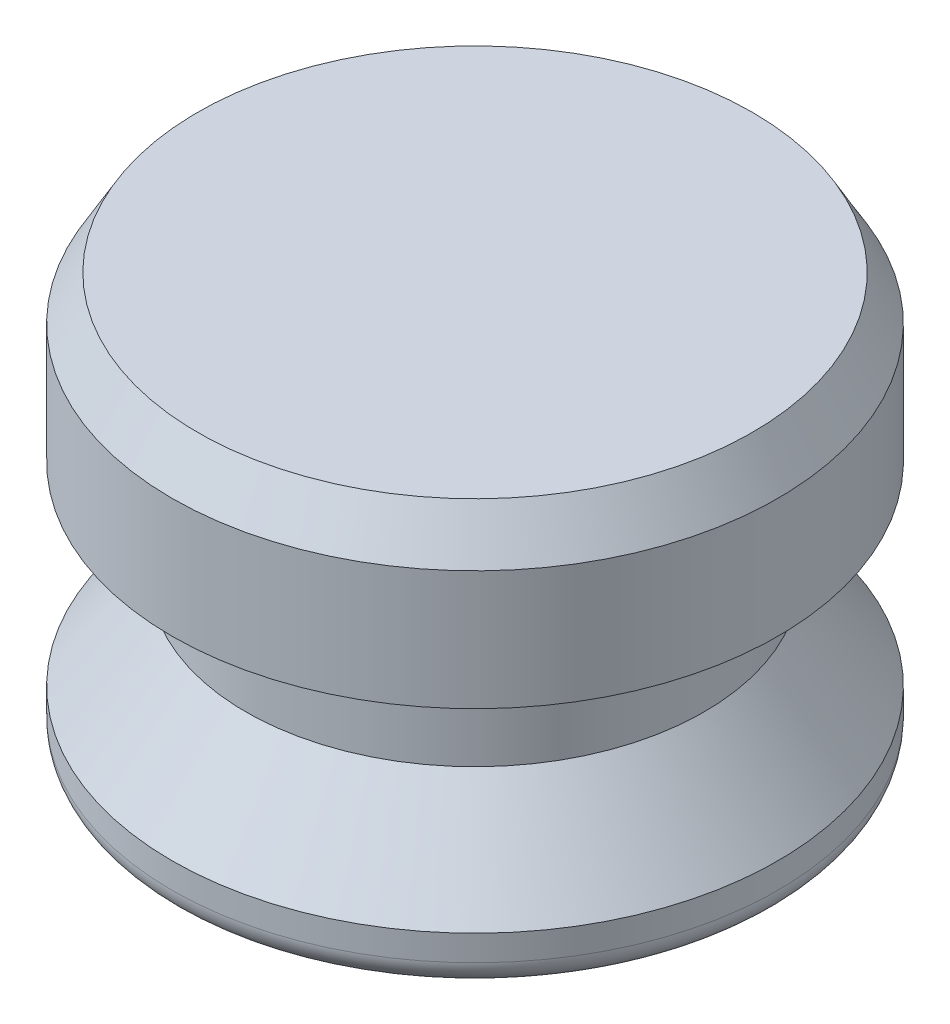
ISO-10303-21;
HEADER;
FILE_DESCRIPTION(('STEP AP214'),'2;1');
FILE_NAME('part.step','',(''),(''),'','','');
FILE_SCHEMA(('AUTOMOTIVE_DESIGN { 1 0 10303 214 1 1 1 1 }'));
ENDSEC;
DATA;
#1=APPLICATION_CONTEXT('core data for automotive mechanical design processes');
#2=APPLICATION_PROTOCOL_DEFINITION('international standard','automotive_design',2000,#1);
#3=PRODUCT_CONTEXT('',#1,'mechanical');
#4=PRODUCT('Part','Part','',(#3));
#5=PRODUCT_RELATED_PRODUCT_CATEGORY('part','',(#4));
#6=PRODUCT_DEFINITION_FORMATION('','',#4);
#7=PRODUCT_DEFINITION_CONTEXT('part definition',#1,'design');
#8=PRODUCT_DEFINITION('design','',#6,#7);
#9=PRODUCT_DEFINITION_SHAPE('','',#8);
#10=(LENGTH_UNIT() NAMED_UNIT(*) SI_UNIT(.MILLI.,.METRE.));
#11=(NAMED_UNIT(*) PLANE_ANGLE_UNIT() SI_UNIT($,.RADIAN.));
#12=(NAMED_UNIT(*) SI_UNIT($,.STERADIAN.) SOLID_ANGLE_UNIT());
#13=UNCERTAINTY_MEASURE_WITH_UNIT(LENGTH_MEASURE(1.E-05),#10,'distance_accuracy_value','');
#14=(GEOMETRIC_REPRESENTATION_CONTEXT(3) GLOBAL_UNCERTAINTY_ASSIGNED_CONTEXT((#13)) GLOBAL_UNIT_ASSIGNED_CONTEXT((#10,
#11,#12)) REPRESENTATION_CONTEXT('',''));
#15=CARTESIAN_POINT('',(0.,0.,0.));
#16=DIRECTION('',(0.,0.,1.));
#17=DIRECTION('',(1.,0.,0.));
#18=AXIS2_PLACEMENT_3D('',#15,#16,#17);
#19=CARTESIAN_POINT('',(0.,0.,0.));
#20=DIRECTION('',(0.,1.,0.));
#21=DIRECTION('',(0.,0.,1.));
#22=AXIS2_PLACEMENT_3D('',#19,#20,#21);
#23=PLANE('',#22);
#24=CARTESIAN_POINT('',(0.,0.,0.));
#25=DIRECTION('',(0.,1.,0.));
#26=DIRECTION('',(0.,0.,1.));
#27=AXIS2_PLACEMENT_3D('',#24,#25,#26);
#28=CIRCLE('',#27,8.60425);
#29=CARTESIAN_POINT('',(0.,0.,8.60425));
#30=VERTEX_POINT('',#29);
#31=EDGE_CURVE('E46',#30,#30,#28,.F.);
#32=ORIENTED_EDGE('',*,*,#31,.T.);
#33=EDGE_LOOP('',(#32));
#34=FACE_BOUND('',#33,.T.);
#35=ADVANCED_FACE('F31',(#34),#23,.F.);
#36=CARTESIAN_POINT('',(0.,0.,0.));
#37=DIRECTION('',(0.,-1.,0.));
#38=DIRECTION('',(0.,0.,-1.));
#39=AXIS2_PLACEMENT_3D('',#36,#37,#38);
#40=CYLINDRICAL_SURFACE('',#39,9.398);
#41=CARTESIAN_POINT('',(0.,0.793749999999999,0.));
#42=DIRECTION('',(0.,1.,0.));
#43=DIRECTION('',(0.,0.,1.));
#44=AXIS2_PLACEMENT_3D('',#41,#42,#43);
#45=CIRCLE('',#44,9.398);
#46=CARTESIAN_POINT('',(0.,0.793749999999999,9.398));
#47=VERTEX_POINT('',#46);
#48=EDGE_CURVE('E42',#47,#47,#45,.T.);
#49=ORIENTED_EDGE('',*,*,#48,.T.);
#50=EDGE_LOOP('',(#49));
#51=FACE_BOUND('',#50,.T.);
#52=CARTESIAN_POINT('',(0.,1.5875,0.));
#53=DIRECTION('',(0.,-1.,0.));
#54=DIRECTION('',(0.,0.,-1.));
#55=AXIS2_PLACEMENT_3D('',#52,#53,#54);
#56=CIRCLE('',#55,9.398);
#57=CARTESIAN_POINT('',(0.,1.5875,-9.398));
#58=VERTEX_POINT('',#57);
#59=EDGE_CURVE('E51',#58,#58,#56,.T.);
#60=ORIENTED_EDGE('',*,*,#59,.T.);
#61=EDGE_LOOP('',(#60));
#62=FACE_BOUND('',#61,.T.);
#63=ADVANCED_FACE('F80',(#51,#62),#40,.T.);
#64=CARTESIAN_POINT('',(0.,4.445,0.));
#65=DIRECTION('',(0.,-1.,0.));
#66=DIRECTION('',(0.,0.,-1.));
#67=AXIS2_PLACEMENT_3D('',#64,#65,#66);
#68=CONICAL_SURFACE('',#67,7.112,0.674740942223553);
#69=ORIENTED_EDGE('',*,*,#59,.F.);
#70=EDGE_LOOP('',(#69));
#71=FACE_BOUND('',#70,.T.);
#72=CARTESIAN_POINT('',(0.,4.445,0.));
#73=DIRECTION('',(0.,-1.,0.));
#74=DIRECTION('',(0.,0.,-1.));
#75=AXIS2_PLACEMENT_3D('',#72,#73,#74);
#76=CIRCLE('',#75,7.112);
#77=CARTESIAN_POINT('',(0.,4.445,-7.112));
#78=VERTEX_POINT('',#77);
#79=EDGE_CURVE('E54',#78,#78,#76,.T.);
#80=ORIENTED_EDGE('',*,*,#79,.T.);
#81=EDGE_LOOP('',(#80));
#82=FACE_BOUND('',#81,.T.);
#83=ADVANCED_FACE('F86',(#71,#82),#68,.T.);
#84=CARTESIAN_POINT('',(0.,0.,0.));
#85=DIRECTION('',(0.,-1.,0.));
#86=DIRECTION('',(0.,0.,-1.));
#87=AXIS2_PLACEMENT_3D('',#84,#85,#86);
#88=CYLINDRICAL_SURFACE('',#87,7.112);
#89=ORIENTED_EDGE('',*,*,#79,.F.);
#90=EDGE_LOOP('',(#89));
#91=FACE_BOUND('',#90,.T.);
#92=CARTESIAN_POINT('',(0.,7.62,0.));
#93=DIRECTION('',(0.,-1.,0.));
#94=DIRECTION('',(0.,0.,-1.));
#95=AXIS2_PLACEMENT_3D('',#92,#93,#94);
#96=CIRCLE('',#95,7.112);
#97=CARTESIAN_POINT('',(0.,7.62,-7.112));
#98=VERTEX_POINT('',#97);
#99=EDGE_CURVE('E57',#98,#98,#96,.T.);
#100=ORIENTED_EDGE('',*,*,#99,.T.);
#101=EDGE_LOOP('',(#100));
#102=FACE_BOUND('',#101,.T.);
#103=ADVANCED_FACE('F76',(#91,#102),#88,.T.);
#104=CARTESIAN_POINT('',(-7.112,7.62,0.));
#105=DIRECTION('',(0.,1.,0.));
#106=DIRECTION('',(0.,0.,1.));
#107=AXIS2_PLACEMENT_3D('',#104,#105,#106);
#108=PLANE('',#107);
#109=ORIENTED_EDGE('',*,*,#99,.F.);
#110=EDGE_LOOP('',(#109));
#111=FACE_BOUND('',#110,.T.);
#112=CARTESIAN_POINT('',(0.,7.62,0.));
#113=DIRECTION('',(0.,-1.,0.));
#114=DIRECTION('',(0.,0.,-1.));
#115=AXIS2_PLACEMENT_3D('',#112,#113,#114);
#116=CIRCLE('',#115,9.398);
#117=CARTESIAN_POINT('',(0.,7.62,-9.398));
#118=VERTEX_POINT('',#117);
#119=EDGE_CURVE('E60',#118,#118,#116,.T.);
#120=ORIENTED_EDGE('',*,*,#119,.T.);
#121=EDGE_LOOP('',(#120));
#122=FACE_BOUND('',#121,.T.);
#123=ADVANCED_FACE('F64',(#111,#122),#108,.F.);
#124=CARTESIAN_POINT('',(0.,0.,0.));
#125=DIRECTION('',(0.,-1.,0.));
#126=DIRECTION('',(0.,0.,-1.));
#127=AXIS2_PLACEMENT_3D('',#124,#125,#126);
#128=CYLINDRICAL_SURFACE('',#127,9.398);
#129=CARTESIAN_POINT('',(0.,11.3251846714922,0.));
#130=DIRECTION('',(0.,-1.,0.));
#131=DIRECTION('',(0.,0.,-1.));
#132=AXIS2_PLACEMENT_3D('',#129,#130,#131);
#133=CIRCLE('',#132,9.398);
#134=CARTESIAN_POINT('',(0.,11.3251846714922,-9.398));
#135=VERTEX_POINT('',#134);
#136=EDGE_CURVE('E38',#135,#135,#133,.T.);
#137=ORIENTED_EDGE('',*,*,#136,.T.);
#138=EDGE_LOOP('',(#137));
#139=FACE_BOUND('',#138,.T.);
#140=ORIENTED_EDGE('',*,*,#119,.F.);
#141=EDGE_LOOP('',(#140));
#142=FACE_BOUND('',#141,.T.);
#143=ADVANCED_FACE('F66',(#139,#142),#128,.T.);
#144=CARTESIAN_POINT('',(-9.398,12.7,0.));
#145=DIRECTION('',(0.,-1.,0.));
#146=DIRECTION('',(0.,0.,-1.));
#147=AXIS2_PLACEMENT_3D('',#144,#145,#146);
#148=PLANE('',#147);
#149=CARTESIAN_POINT('',(0.,12.7,0.));
#150=DIRECTION('',(0.,-1.,0.));
#151=DIRECTION('',(0.,0.,-1.));
#152=AXIS2_PLACEMENT_3D('',#149,#150,#151);
#153=CIRCLE('',#152,8.60424999999999);
#154=CARTESIAN_POINT('',(0.,12.7,-8.60424999999999));
#155=VERTEX_POINT('',#154);
#156=EDGE_CURVE('E10',#155,#155,#153,.F.);
#157=ORIENTED_EDGE('',*,*,#156,.T.);
#158=EDGE_LOOP('',(#157));
#159=FACE_BOUND('',#158,.T.);
#160=ADVANCED_FACE('F68',(#159),#148,.F.);
#161=CARTESIAN_POINT('',(0.,0.793749999999999,0.));
#162=DIRECTION('',(0.,1.,0.));
#163=DIRECTION('',(0.,0.,1.));
#164=AXIS2_PLACEMENT_3D('',#161,#162,#163);
#165=TOROIDAL_SURFACE('',#164,8.60425,0.79375);
#166=ORIENTED_EDGE('',*,*,#48,.F.);
#167=EDGE_LOOP('',(#166));
#168=FACE_BOUND('',#167,.T.);
#169=ORIENTED_EDGE('',*,*,#31,.F.);
#170=EDGE_LOOP('',(#169));
#171=FACE_BOUND('',#170,.T.);
#172=ADVANCED_FACE('F74',(#168,#171),#165,.T.);
#173=CARTESIAN_POINT('',(0.,11.3251846714922,0.));
#174=DIRECTION('',(0.,-1.,0.));
#175=DIRECTION('',(0.,0.,-1.));
#176=AXIS2_PLACEMENT_3D('',#173,#174,#175);
#177=CONICAL_SURFACE('',#176,9.398,0.5235987755983);
#178=ORIENTED_EDGE('',*,*,#156,.F.);
#179=EDGE_LOOP('',(#178));
#180=FACE_BOUND('',#179,.T.);
#181=ORIENTED_EDGE('',*,*,#136,.F.);
#182=EDGE_LOOP('',(#181));
#183=FACE_BOUND('',#182,.T.);
#184=ADVANCED_FACE('F33',(#180,#183),#177,.T.);
#185=CLOSED_SHELL('',(#35,#63,#83,#103,#123,#143,#160,#172,#184));
#186=MANIFOLD_SOLID_BREP('B2',#185);
#187=ADVANCED_BREP_SHAPE_REPRESENTATION('',(#18,#186),#14);
#188=SHAPE_DEFINITION_REPRESENTATION(#9,#187);
ENDSEC;
END-ISO-10303-21;
